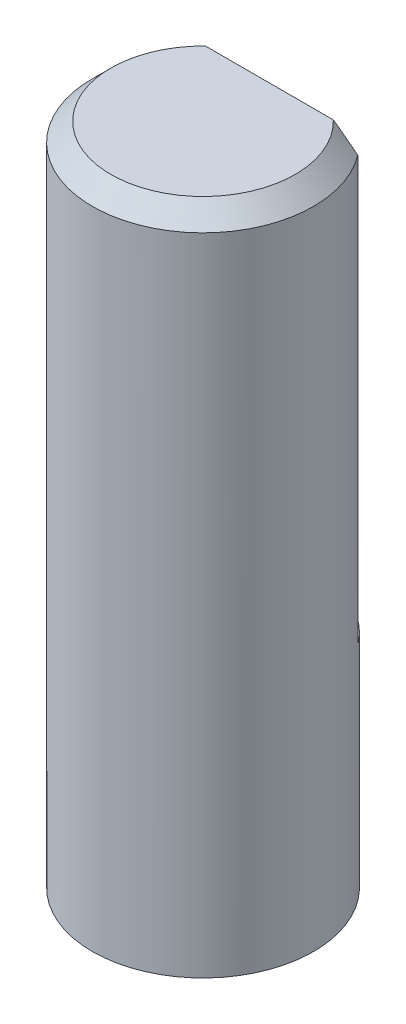
ISO-10303-21;
HEADER;
FILE_DESCRIPTION(('STEP AP214'),'2;1');
FILE_NAME('part.step','',(''),(''),'','','');
FILE_SCHEMA(('AUTOMOTIVE_DESIGN { 1 0 10303 214 1 1 1 1 }'));
ENDSEC;
DATA;
#1=APPLICATION_CONTEXT('core data for automotive mechanical design processes');
#2=APPLICATION_PROTOCOL_DEFINITION('international standard','automotive_design',2000,#1);
#3=PRODUCT_CONTEXT('',#1,'mechanical');
#4=PRODUCT('Part','Part','',(#3));
#5=PRODUCT_RELATED_PRODUCT_CATEGORY('part','',(#4));
#6=PRODUCT_DEFINITION_FORMATION('','',#4);
#7=PRODUCT_DEFINITION_CONTEXT('part definition',#1,'design');
#8=PRODUCT_DEFINITION('design','',#6,#7);
#9=PRODUCT_DEFINITION_SHAPE('','',#8);
#10=(LENGTH_UNIT() NAMED_UNIT(*) SI_UNIT(.MILLI.,.METRE.));
#11=(NAMED_UNIT(*) PLANE_ANGLE_UNIT() SI_UNIT($,.RADIAN.));
#12=(NAMED_UNIT(*) SI_UNIT($,.STERADIAN.) SOLID_ANGLE_UNIT());
#13=UNCERTAINTY_MEASURE_WITH_UNIT(LENGTH_MEASURE(1.E-05),#10,'distance_accuracy_value','');
#14=(GEOMETRIC_REPRESENTATION_CONTEXT(3) GLOBAL_UNCERTAINTY_ASSIGNED_CONTEXT((#13)) GLOBAL_UNIT_ASSIGNED_CONTEXT((#10,
#11,#12)) REPRESENTATION_CONTEXT('',''));
#15=CARTESIAN_POINT('',(0.,0.,0.));
#16=DIRECTION('',(0.,0.,1.));
#17=DIRECTION('',(1.,0.,0.));
#18=AXIS2_PLACEMENT_3D('',#15,#16,#17);
#19=CARTESIAN_POINT('',(0.,18.,0.));
#20=DIRECTION('',(0.,-1.,0.));
#21=DIRECTION('',(0.,0.,-1.));
#22=AXIS2_PLACEMENT_3D('',#19,#20,#21);
#23=CYLINDRICAL_SURFACE('',#22,3.);
#24=CARTESIAN_POINT('',(0.,17.5,0.));
#25=DIRECTION('',(0.,1.,0.));
#26=DIRECTION('',(0.,0.,1.));
#27=AXIS2_PLACEMENT_3D('',#24,#25,#26);
#28=CIRCLE('',#27,3.);
#29=CARTESIAN_POINT('',(2.4,17.5,-1.8));
#30=VERTEX_POINT('',#29);
#31=CARTESIAN_POINT('',(-2.4,17.5,-1.8));
#32=VERTEX_POINT('',#31);
#33=EDGE_CURVE('E95',#30,#32,#28,.F.);
#34=ORIENTED_EDGE('',*,*,#33,.T.);
#35=DIRECTION('',(0.,1.,0.));
#36=VECTOR('',#35,1.);
#37=CARTESIAN_POINT('',(-2.4,6.,-1.8));
#38=LINE('',#37,#36);
#39=CARTESIAN_POINT('',(-2.4,6.,-1.8));
#40=VERTEX_POINT('',#39);
#41=EDGE_CURVE('E60',#40,#32,#38,.T.);
#42=ORIENTED_EDGE('',*,*,#41,.F.);
#43=CARTESIAN_POINT('',(0.,6.,0.));
#44=DIRECTION('',(0.,1.,0.));
#45=DIRECTION('',(0.,0.,1.));
#46=AXIS2_PLACEMENT_3D('',#43,#44,#45);
#47=CIRCLE('',#46,3.);
#48=CARTESIAN_POINT('',(2.4,6.,-1.8));
#49=VERTEX_POINT('',#48);
#50=EDGE_CURVE('E80',#49,#40,#47,.T.);
#51=ORIENTED_EDGE('',*,*,#50,.F.);
#52=DIRECTION('',(0.,1.,0.));
#53=VECTOR('',#52,1.);
#54=CARTESIAN_POINT('',(2.4,6.,-1.8));
#55=LINE('',#54,#53);
#56=EDGE_CURVE('E71',#49,#30,#55,.T.);
#57=ORIENTED_EDGE('',*,*,#56,.T.);
#58=EDGE_LOOP('',(#34,#42,#51,#57));
#59=FACE_BOUND('',#58,.T.);
#60=CARTESIAN_POINT('',(0.,0.,0.));
#61=DIRECTION('',(0.,1.,0.));
#62=DIRECTION('',(0.,0.,1.));
#63=AXIS2_PLACEMENT_3D('',#60,#61,#62);
#64=CIRCLE('',#63,3.);
#65=CARTESIAN_POINT('',(0.,0.,3.));
#66=VERTEX_POINT('',#65);
#67=EDGE_CURVE('E89',#66,#66,#64,.T.);
#68=ORIENTED_EDGE('',*,*,#67,.T.);
#69=EDGE_LOOP('',(#68));
#70=FACE_BOUND('',#69,.T.);
#71=ADVANCED_FACE('F35',(#59,#70),#23,.T.);
#72=CARTESIAN_POINT('',(0.,18.,0.));
#73=DIRECTION('',(0.,1.,0.));
#74=DIRECTION('',(0.,0.,1.));
#75=AXIS2_PLACEMENT_3D('',#72,#73,#74);
#76=PLANE('',#75);
#77=DIRECTION('',(1.,0.,0.));
#78=VECTOR('',#77,1.);
#79=CARTESIAN_POINT('',(-2.4,18.,-1.8));
#80=LINE('',#79,#78);
#81=CARTESIAN_POINT('',(-1.73493515728975,18.,-1.8));
#82=VERTEX_POINT('',#81);
#83=CARTESIAN_POINT('',(1.73493515728975,18.,-1.8));
#84=VERTEX_POINT('',#83);
#85=EDGE_CURVE('E54',#82,#84,#80,.T.);
#86=ORIENTED_EDGE('',*,*,#85,.F.);
#87=CARTESIAN_POINT('',(0.,18.,0.));
#88=DIRECTION('',(0.,1.,0.));
#89=DIRECTION('',(0.,0.,1.));
#90=AXIS2_PLACEMENT_3D('',#87,#88,#89);
#91=CIRCLE('',#90,2.5);
#92=EDGE_CURVE('E93',#82,#84,#91,.T.);
#93=ORIENTED_EDGE('',*,*,#92,.T.);
#94=EDGE_LOOP('',(#86,#93));
#95=FACE_BOUND('',#94,.T.);
#96=ADVANCED_FACE('F99',(#95),#76,.T.);
#97=CARTESIAN_POINT('',(0.,0.,0.));
#98=DIRECTION('',(0.,1.,0.));
#99=DIRECTION('',(0.,0.,1.));
#100=AXIS2_PLACEMENT_3D('',#97,#98,#99);
#101=PLANE('',#100);
#102=ORIENTED_EDGE('',*,*,#67,.F.);
#103=EDGE_LOOP('',(#102));
#104=FACE_BOUND('',#103,.T.);
#105=ADVANCED_FACE('F101',(#104),#101,.F.);
#106=CARTESIAN_POINT('',(0.,18.,0.));
#107=DIRECTION('',(0.,-1.,0.));
#108=DIRECTION('',(0.,0.,-1.));
#109=AXIS2_PLACEMENT_3D('',#106,#107,#108);
#110=CONICAL_SURFACE('',#109,2.5,0.785398163397448);
#111=CARTESIAN_POINT('',(-5.29578284288328,14.9066721963596,-1.8));
#112=CARTESIAN_POINT('',(-5.12285180266291,15.0703540126584,-1.8));
#113=CARTESIAN_POINT('',(-4.94955019645599,15.2336504095275,-1.8));
#114=CARTESIAN_POINT('',(-4.60162438118305,15.5592473838574,-1.8));
#115=CARTESIAN_POINT('',(-4.42699883391852,15.7215465302245,-1.8));
#116=CARTESIAN_POINT('',(-4.06851224534989,16.0516608721901,-1.8));
#117=CARTESIAN_POINT('',(-3.88458392141662,16.2194031296405,-1.8));
#118=CARTESIAN_POINT('',(-3.51459877302508,16.552115561214,-1.8));
#119=CARTESIAN_POINT('',(-3.3285445876314,16.7170886526615,-1.8));
#120=CARTESIAN_POINT('',(-3.0469552865494,16.9613852102644,-1.8));
#121=CARTESIAN_POINT('',(-2.95274357195754,17.0422325960205,-1.8));
#122=CARTESIAN_POINT('',(-2.76320922654278,17.2026126022802,-1.8));
#123=CARTESIAN_POINT('',(-2.66788662596549,17.2821452584374,-1.8));
#124=CARTESIAN_POINT('',(-2.47547651174436,17.4397830383105,-1.8));
#125=CARTESIAN_POINT('',(-2.37838379128246,17.5178818262759,-1.8));
#126=CARTESIAN_POINT('',(-2.18237585089865,17.6717370747434,-1.8));
#127=CARTESIAN_POINT('',(-2.08346092711413,17.7474939105837,-1.8));
#128=CARTESIAN_POINT('',(-1.88532169174342,17.894219628657,-1.8));
#129=CARTESIAN_POINT('',(-1.78614736284381,17.9652556001344,-1.8));
#130=CARTESIAN_POINT('',(-1.5846683568887,18.1029700141344,-1.8));
#131=CARTESIAN_POINT('',(-1.48236132429949,18.1696450532922,-1.8));
#132=CARTESIAN_POINT('',(-1.27439518990201,18.2960736980376,-1.8));
#133=CARTESIAN_POINT('',(-1.1687613448564,18.355868364682,-1.8));
#134=CARTESIAN_POINT('',(-0.952556163795937,18.4656166003948,-1.8));
#135=CARTESIAN_POINT('',(-0.841995054764684,18.5155894860828,-1.8));
#136=CARTESIAN_POINT('',(-0.67571400546358,18.5779707744145,-1.8));
#137=CARTESIAN_POINT('',(-0.622180982305442,18.5962022888381,-1.8));
#138=CARTESIAN_POINT('',(-0.513910266480796,18.6287873383075,-1.8));
#139=CARTESIAN_POINT('',(-0.459172176697258,18.6431395736471,-1.8));
#140=CARTESIAN_POINT('',(-0.348992821062411,18.6672628138493,-1.8));
#141=CARTESIAN_POINT('',(-0.293556967868144,18.6770582049487,-1.8));
#142=CARTESIAN_POINT('',(-0.182034692593678,18.6916627606029,-1.8));
#143=CARTESIAN_POINT('',(-0.125948428950475,18.6964731147207,-1.8));
#144=CARTESIAN_POINT('',(-0.0132008668996252,18.7008386657294,-1.8));
#145=CARTESIAN_POINT('',(0.0434617950341464,18.7003593453081,-1.8));
#146=CARTESIAN_POINT('',(0.15648774149834,18.6940921780968,-1.8));
#147=CARTESIAN_POINT('',(0.212851022487892,18.6883042686605,-1.8));
#148=CARTESIAN_POINT('',(0.325096233526428,18.671724967809,-1.8));
#149=CARTESIAN_POINT('',(0.380974656979358,18.6609101918883,-1.8));
#150=CARTESIAN_POINT('',(0.491676832762132,18.6348327137508,-1.8));
#151=CARTESIAN_POINT('',(0.54650036964537,18.6195691129868,-1.8));
#152=CARTESIAN_POINT('',(0.688019766423603,18.5747703856724,-1.8));
#153=CARTESIAN_POINT('',(0.773755994279863,18.5422094516917,-1.8));
#154=CARTESIAN_POINT('',(0.942080002539032,18.4697969263594,-1.8));
#155=CARTESIAN_POINT('',(1.02466506086554,18.4299391967279,-1.8));
#156=CARTESIAN_POINT('',(1.18780091303287,18.3445424570655,-1.8));
#157=CARTESIAN_POINT('',(1.26832535988246,18.2989536643178,-1.8));
#158=CARTESIAN_POINT('',(1.38730526076978,18.2276412203138,-1.8));
#159=CARTESIAN_POINT('',(1.42665708647506,18.2033868873823,-1.8));
#160=CARTESIAN_POINT('',(1.50482372835086,18.15402980513,-1.8));
#161=CARTESIAN_POINT('',(1.54363856520485,18.1289270886157,-1.8));
#162=CARTESIAN_POINT('',(1.67182501563615,18.0443017298246,-1.8));
#163=CARTESIAN_POINT('',(1.76014213154034,17.9831809982279,-1.8));
#164=CARTESIAN_POINT('',(1.93475691237975,17.8581099630329,-1.8));
#165=CARTESIAN_POINT('',(2.02105414744676,17.7941590653449,-1.8));
#166=CARTESIAN_POINT('',(2.19210447719125,17.6641168712498,-1.8));
#167=CARTESIAN_POINT('',(2.2768565264644,17.5980242040805,-1.8));
#168=CARTESIAN_POINT('',(2.44508801948856,17.4642354600927,-1.8));
#169=CARTESIAN_POINT('',(2.52856739356204,17.3965392959989,-1.8));
#170=CARTESIAN_POINT('',(2.77799047736409,17.1911877411021,-1.8));
#171=CARTESIAN_POINT('',(2.94240007196368,17.0516713782478,-1.8));
#172=CARTESIAN_POINT('',(3.26843637260826,16.7695759942704,-1.8));
#173=CARTESIAN_POINT('',(3.43006413095913,16.6269981792333,-1.8));
#174=CARTESIAN_POINT('',(3.73546723091933,16.3539753142177,-1.8));
#175=CARTESIAN_POINT('',(3.87942213606178,16.2237307458772,-1.8));
#176=CARTESIAN_POINT('',(4.16619516720294,15.9619650961217,-1.8));
#177=CARTESIAN_POINT('',(4.30901315898711,15.830443867946,-1.8));
#178=CARTESIAN_POINT('',(4.59288247936315,15.5672779669628,-1.8));
#179=CARTESIAN_POINT('',(4.73393927099943,15.4356391790714,-1.8));
#180=CARTESIAN_POINT('',(5.0153431952258,15.1716466142537,-1.8));
#181=CARTESIAN_POINT('',(5.15569042994564,15.0392929462436,-1.8));
#182=CARTESIAN_POINT('',(5.29578284288328,14.9066721963596,-1.8));
#183=B_SPLINE_CURVE_WITH_KNOTS('',3,(#111,#112,#113,#114,#115,#116,#117,#118,#119,#120,#121,
#122,#123,#124,#125,#126,#127,#128,#129,#130,#131,#132,#133,#134,#135,#136,#137,#138,#139,#140,
#141,#142,#143,#144,#145,#146,#147,#148,#149,#150,#151,#152,#153,#154,#155,#156,#157,#158,#159,
#160,#161,#162,#163,#164,#165,#166,#167,#168,#169,#170,#171,#172,#173,#174,#175,#176,#177,#178,
#179,#180,#181,#182),.UNSPECIFIED.,.F.,.F.,(4,2,2,2,2,2,2,2,2,2,2,2,2,2,2,2,2,2,2,2,2,2,2,2,2,2,
2,2,2,2,2,2,2,2,2,4),(0.,0.714339121129969,1.4295359451444,2.17631800258365,2.92225648956363,
3.29468470304652,3.66710280016944,4.04089238896473,4.4146217576662,4.7805141986725,
5.14668886423431,5.51055046501753,5.8736891319736,6.04322842397081,6.21282444787905,
6.38150212030355,6.55013953245812,6.71987802063261,6.88961851190608,7.06015664612701,
7.23072924851931,7.50536044755127,7.7802237450112,8.05766521368626,8.19633537101629,
8.33500017216291,8.65712483021718,8.9793174302738,9.30172047707967,9.62414111215304,
10.2709512389679,10.9175110620876,11.4998923501344,12.0823413989977,12.6611581113517,
13.2398889942293),.UNSPECIFIED.);
#184=EDGE_CURVE('E11',#32,#82,#183,.T.);
#185=ORIENTED_EDGE('',*,*,#184,.F.);
#186=ORIENTED_EDGE('',*,*,#33,.F.);
#187=EDGE_CURVE('E40',#84,#30,#183,.T.);
#188=ORIENTED_EDGE('',*,*,#187,.F.);
#189=ORIENTED_EDGE('',*,*,#92,.F.);
#190=EDGE_LOOP('',(#185,#186,#188,#189));
#191=FACE_BOUND('',#190,.T.);
#192=ADVANCED_FACE('F37',(#191),#110,.T.);
#193=CARTESIAN_POINT('',(-2.4,6.,-1.8));
#194=DIRECTION('',(0.,0.,1.));
#195=DIRECTION('',(1.,0.,0.));
#196=AXIS2_PLACEMENT_3D('',#193,#194,#195);
#197=PLANE('',#196);
#198=ORIENTED_EDGE('',*,*,#184,.T.);
#199=ORIENTED_EDGE('',*,*,#85,.T.);
#200=ORIENTED_EDGE('',*,*,#187,.T.);
#201=ORIENTED_EDGE('',*,*,#56,.F.);
#202=DIRECTION('',(1.,0.,0.));
#203=VECTOR('',#202,1.);
#204=CARTESIAN_POINT('',(-2.4,6.,-1.8));
#205=LINE('',#204,#203);
#206=EDGE_CURVE('E74',#40,#49,#205,.T.);
#207=ORIENTED_EDGE('',*,*,#206,.F.);
#208=ORIENTED_EDGE('',*,*,#41,.T.);
#209=EDGE_LOOP('',(#198,#199,#200,#201,#207,#208));
#210=FACE_BOUND('',#209,.T.);
#211=ADVANCED_FACE('F73',(#210),#197,.F.);
#212=CARTESIAN_POINT('',(0.,6.,0.));
#213=DIRECTION('',(0.,1.,0.));
#214=DIRECTION('',(0.,0.,1.));
#215=AXIS2_PLACEMENT_3D('',#212,#213,#214);
#216=PLANE('',#215);
#217=ORIENTED_EDGE('',*,*,#206,.T.);
#218=ORIENTED_EDGE('',*,*,#50,.T.);
#219=EDGE_LOOP('',(#217,#218));
#220=FACE_BOUND('',#219,.T.);
#221=ADVANCED_FACE('F83',(#220),#216,.T.);
#222=CLOSED_SHELL('',(#71,#96,#105,#192,#211,#221));
#223=MANIFOLD_SOLID_BREP('B2',#222);
#224=ADVANCED_BREP_SHAPE_REPRESENTATION('',(#18,#223),#14);
#225=SHAPE_DEFINITION_REPRESENTATION(#9,#224);
ENDSEC;
END-ISO-10303-21;
